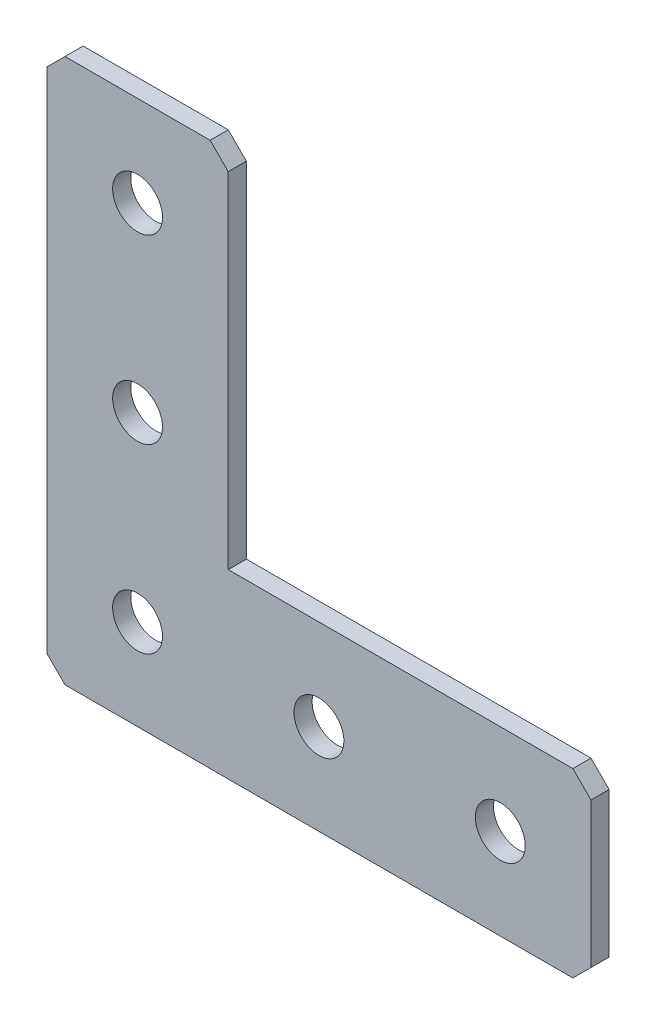
ISO-10303-21;
HEADER;
FILE_DESCRIPTION(('STEP AP214'),'2;1');
FILE_NAME('part.step','',(''),(''),'','','');
FILE_SCHEMA(('AUTOMOTIVE_DESIGN { 1 0 10303 214 1 1 1 1 }'));
ENDSEC;
DATA;
#1=APPLICATION_CONTEXT('core data for automotive mechanical design processes');
#2=APPLICATION_PROTOCOL_DEFINITION('international standard','automotive_design',2000,#1);
#3=PRODUCT_CONTEXT('',#1,'mechanical');
#4=PRODUCT('Part','Part','',(#3));
#5=PRODUCT_RELATED_PRODUCT_CATEGORY('part','',(#4));
#6=PRODUCT_DEFINITION_FORMATION('','',#4);
#7=PRODUCT_DEFINITION_CONTEXT('part definition',#1,'design');
#8=PRODUCT_DEFINITION('design','',#6,#7);
#9=PRODUCT_DEFINITION_SHAPE('','',#8);
#10=(LENGTH_UNIT() NAMED_UNIT(*) SI_UNIT(.MILLI.,.METRE.));
#11=(NAMED_UNIT(*) PLANE_ANGLE_UNIT() SI_UNIT($,.RADIAN.));
#12=(NAMED_UNIT(*) SI_UNIT($,.STERADIAN.) SOLID_ANGLE_UNIT());
#13=UNCERTAINTY_MEASURE_WITH_UNIT(LENGTH_MEASURE(1.E-05),#10,'distance_accuracy_value','');
#14=(GEOMETRIC_REPRESENTATION_CONTEXT(3) GLOBAL_UNCERTAINTY_ASSIGNED_CONTEXT((#13)) GLOBAL_UNIT_ASSIGNED_CONTEXT((#10,
#11,#12)) REPRESENTATION_CONTEXT('',''));
#15=CARTESIAN_POINT('',(0.,0.,0.));
#16=DIRECTION('',(0.,0.,1.));
#17=DIRECTION('',(1.,0.,0.));
#18=AXIS2_PLACEMENT_3D('',#15,#16,#17);
#19=CARTESIAN_POINT('',(20.,0.,-2.));
#20=DIRECTION('',(0.,-1.,0.));
#21=DIRECTION('',(1.,0.,0.));
#22=AXIS2_PLACEMENT_3D('',#19,#20,#21);
#23=PLANE('',#22);
#24=DIRECTION('',(1.,0.,0.));
#25=VECTOR('',#24,1.);
#26=CARTESIAN_POINT('',(20.,0.,-2.));
#27=LINE('',#26,#25);
#28=CARTESIAN_POINT('',(2.00000000000001,0.,-2.));
#29=VERTEX_POINT('',#28);
#30=CARTESIAN_POINT('',(18.,0.,-2.));
#31=VERTEX_POINT('',#30);
#32=EDGE_CURVE('E137',#29,#31,#27,.T.);
#33=ORIENTED_EDGE('',*,*,#32,.F.);
#34=DIRECTION('',(0.,0.,1.));
#35=VECTOR('',#34,1.);
#36=CARTESIAN_POINT('',(2.00000000000001,0.,-2.));
#37=LINE('',#36,#35);
#38=CARTESIAN_POINT('',(2.00000000000001,0.,0.));
#39=VERTEX_POINT('',#38);
#40=EDGE_CURVE('E189',#29,#39,#37,.T.);
#41=ORIENTED_EDGE('',*,*,#40,.T.);
#42=DIRECTION('',(1.,0.,0.));
#43=VECTOR('',#42,1.);
#44=CARTESIAN_POINT('',(20.,0.,0.));
#45=LINE('',#44,#43);
#46=CARTESIAN_POINT('',(18.,0.,0.));
#47=VERTEX_POINT('',#46);
#48=EDGE_CURVE('E166',#39,#47,#45,.T.);
#49=ORIENTED_EDGE('',*,*,#48,.T.);
#50=DIRECTION('',(0.,0.,-1.));
#51=VECTOR('',#50,1.);
#52=CARTESIAN_POINT('',(18.,0.,-2.));
#53=LINE('',#52,#51);
#54=EDGE_CURVE('E148',#47,#31,#53,.T.);
#55=ORIENTED_EDGE('',*,*,#54,.T.);
#56=EDGE_LOOP('',(#33,#41,#49,#55));
#57=FACE_BOUND('',#56,.T.);
#58=ADVANCED_FACE('F39',(#57),#23,.F.);
#59=CARTESIAN_POINT('',(20.,-40.,-2.));
#60=DIRECTION('',(-1.,0.,0.));
#61=DIRECTION('',(0.,-1.,0.));
#62=AXIS2_PLACEMENT_3D('',#59,#60,#61);
#63=PLANE('',#62);
#64=DIRECTION('',(0.,-1.,0.));
#65=VECTOR('',#64,1.);
#66=CARTESIAN_POINT('',(20.,-40.,-2.));
#67=LINE('',#66,#65);
#68=CARTESIAN_POINT('',(20.,-2.00000000000001,-2.));
#69=VERTEX_POINT('',#68);
#70=CARTESIAN_POINT('',(20.,-40.,-2.));
#71=VERTEX_POINT('',#70);
#72=EDGE_CURVE('E123',#69,#71,#67,.T.);
#73=ORIENTED_EDGE('',*,*,#72,.F.);
#74=DIRECTION('',(0.,0.,1.));
#75=VECTOR('',#74,1.);
#76=CARTESIAN_POINT('',(20.,-2.00000000000001,-2.));
#77=LINE('',#76,#75);
#78=CARTESIAN_POINT('',(20.,-2.00000000000001,0.));
#79=VERTEX_POINT('',#78);
#80=EDGE_CURVE('E228',#69,#79,#77,.T.);
#81=ORIENTED_EDGE('',*,*,#80,.T.);
#82=DIRECTION('',(0.,-1.,0.));
#83=VECTOR('',#82,1.);
#84=CARTESIAN_POINT('',(20.,-40.,0.));
#85=LINE('',#84,#83);
#86=CARTESIAN_POINT('',(20.,-40.,0.));
#87=VERTEX_POINT('',#86);
#88=EDGE_CURVE('E143',#79,#87,#85,.T.);
#89=ORIENTED_EDGE('',*,*,#88,.T.);
#90=DIRECTION('',(0.,0.,1.));
#91=VECTOR('',#90,1.);
#92=CARTESIAN_POINT('',(20.,-40.,-2.));
#93=LINE('',#92,#91);
#94=EDGE_CURVE('E140',#71,#87,#93,.T.);
#95=ORIENTED_EDGE('',*,*,#94,.F.);
#96=EDGE_LOOP('',(#73,#81,#89,#95));
#97=FACE_BOUND('',#96,.T.);
#98=ADVANCED_FACE('F141',(#97),#63,.F.);
#99=CARTESIAN_POINT('',(60.,-40.,-2.));
#100=DIRECTION('',(0.,-1.,0.));
#101=DIRECTION('',(1.,0.,0.));
#102=AXIS2_PLACEMENT_3D('',#99,#100,#101);
#103=PLANE('',#102);
#104=DIRECTION('',(1.,0.,0.));
#105=VECTOR('',#104,1.);
#106=CARTESIAN_POINT('',(60.,-40.,0.));
#107=LINE('',#106,#105);
#108=CARTESIAN_POINT('',(58.,-40.,0.));
#109=VERTEX_POINT('',#108);
#110=EDGE_CURVE('E173',#87,#109,#107,.T.);
#111=ORIENTED_EDGE('',*,*,#110,.T.);
#112=DIRECTION('',(0.,0.,-1.));
#113=VECTOR('',#112,1.);
#114=CARTESIAN_POINT('',(58.,-40.,-2.));
#115=LINE('',#114,#113);
#116=CARTESIAN_POINT('',(58.,-40.,-2.));
#117=VERTEX_POINT('',#116);
#118=EDGE_CURVE('E153',#109,#117,#115,.T.);
#119=ORIENTED_EDGE('',*,*,#118,.T.);
#120=DIRECTION('',(1.,0.,0.));
#121=VECTOR('',#120,1.);
#122=CARTESIAN_POINT('',(60.,-40.,-2.));
#123=LINE('',#122,#121);
#124=EDGE_CURVE('E128',#71,#117,#123,.T.);
#125=ORIENTED_EDGE('',*,*,#124,.F.);
#126=ORIENTED_EDGE('',*,*,#94,.T.);
#127=EDGE_LOOP('',(#111,#119,#125,#126));
#128=FACE_BOUND('',#127,.T.);
#129=ADVANCED_FACE('F151',(#128),#103,.F.);
#130=CARTESIAN_POINT('',(60.,-60.,-2.));
#131=DIRECTION('',(-1.,0.,0.));
#132=DIRECTION('',(0.,-1.,0.));
#133=AXIS2_PLACEMENT_3D('',#130,#131,#132);
#134=PLANE('',#133);
#135=DIRECTION('',(0.,-1.,0.));
#136=VECTOR('',#135,1.);
#137=CARTESIAN_POINT('',(60.,-60.,-2.));
#138=LINE('',#137,#136);
#139=CARTESIAN_POINT('',(60.,-42.,-2.));
#140=VERTEX_POINT('',#139);
#141=CARTESIAN_POINT('',(60.,-58.,-2.));
#142=VERTEX_POINT('',#141);
#143=EDGE_CURVE('E155',#140,#142,#138,.T.);
#144=ORIENTED_EDGE('',*,*,#143,.F.);
#145=DIRECTION('',(0.,0.,1.));
#146=VECTOR('',#145,1.);
#147=CARTESIAN_POINT('',(60.,-42.,-2.));
#148=LINE('',#147,#146);
#149=CARTESIAN_POINT('',(60.,-42.,0.));
#150=VERTEX_POINT('',#149);
#151=EDGE_CURVE('E234',#140,#150,#148,.T.);
#152=ORIENTED_EDGE('',*,*,#151,.T.);
#153=DIRECTION('',(0.,-1.,0.));
#154=VECTOR('',#153,1.);
#155=CARTESIAN_POINT('',(60.,-60.,0.));
#156=LINE('',#155,#154);
#157=CARTESIAN_POINT('',(60.,-58.,0.));
#158=VERTEX_POINT('',#157);
#159=EDGE_CURVE('E176',#150,#158,#156,.T.);
#160=ORIENTED_EDGE('',*,*,#159,.T.);
#161=DIRECTION('',(0.,0.,-1.));
#162=VECTOR('',#161,1.);
#163=CARTESIAN_POINT('',(60.,-58.,-2.));
#164=LINE('',#163,#162);
#165=EDGE_CURVE('E231',#158,#142,#164,.T.);
#166=ORIENTED_EDGE('',*,*,#165,.T.);
#167=EDGE_LOOP('',(#144,#152,#160,#166));
#168=FACE_BOUND('',#167,.T.);
#169=ADVANCED_FACE('F244',(#168),#134,.F.);
#170=CARTESIAN_POINT('',(0.,-60.,-2.));
#171=DIRECTION('',(0.,1.,0.));
#172=DIRECTION('',(0.,0.,1.));
#173=AXIS2_PLACEMENT_3D('',#170,#171,#172);
#174=PLANE('',#173);
#175=DIRECTION('',(-1.,0.,0.));
#176=VECTOR('',#175,1.);
#177=CARTESIAN_POINT('',(0.,-60.,-2.));
#178=LINE('',#177,#176);
#179=CARTESIAN_POINT('',(58.,-60.,-2.));
#180=VERTEX_POINT('',#179);
#181=CARTESIAN_POINT('',(2.00000000000001,-60.,-2.));
#182=VERTEX_POINT('',#181);
#183=EDGE_CURVE('E158',#180,#182,#178,.T.);
#184=ORIENTED_EDGE('',*,*,#183,.F.);
#185=DIRECTION('',(0.,0.,1.));
#186=VECTOR('',#185,1.);
#187=CARTESIAN_POINT('',(58.,-60.,-2.));
#188=LINE('',#187,#186);
#189=CARTESIAN_POINT('',(58.,-60.,0.));
#190=VERTEX_POINT('',#189);
#191=EDGE_CURVE('E11',#180,#190,#188,.T.);
#192=ORIENTED_EDGE('',*,*,#191,.T.);
#193=DIRECTION('',(-1.,0.,0.));
#194=VECTOR('',#193,1.);
#195=CARTESIAN_POINT('',(0.,-60.,0.));
#196=LINE('',#195,#194);
#197=CARTESIAN_POINT('',(2.00000000000001,-60.,0.));
#198=VERTEX_POINT('',#197);
#199=EDGE_CURVE('E180',#190,#198,#196,.T.);
#200=ORIENTED_EDGE('',*,*,#199,.T.);
#201=DIRECTION('',(0.,0.,-1.));
#202=VECTOR('',#201,1.);
#203=CARTESIAN_POINT('',(2.00000000000002,-60.,-2.));
#204=LINE('',#203,#202);
#205=EDGE_CURVE('E48',#198,#182,#204,.T.);
#206=ORIENTED_EDGE('',*,*,#205,.T.);
#207=EDGE_LOOP('',(#184,#192,#200,#206));
#208=FACE_BOUND('',#207,.T.);
#209=ADVANCED_FACE('F254',(#208),#174,.F.);
#210=CARTESIAN_POINT('',(0.,0.,-2.));
#211=DIRECTION('',(1.,0.,0.));
#212=DIRECTION('',(0.,0.,-1.));
#213=AXIS2_PLACEMENT_3D('',#210,#211,#212);
#214=PLANE('',#213);
#215=DIRECTION('',(0.,1.,0.));
#216=VECTOR('',#215,1.);
#217=CARTESIAN_POINT('',(0.,0.,0.));
#218=LINE('',#217,#216);
#219=CARTESIAN_POINT('',(0.,-58.,0.));
#220=VERTEX_POINT('',#219);
#221=CARTESIAN_POINT('',(0.,-2.00000000000002,0.));
#222=VERTEX_POINT('',#221);
#223=EDGE_CURVE('E183',#220,#222,#218,.T.);
#224=ORIENTED_EDGE('',*,*,#223,.T.);
#225=DIRECTION('',(0.,0.,-1.));
#226=VECTOR('',#225,1.);
#227=CARTESIAN_POINT('',(0.,-2.00000000000002,-2.));
#228=LINE('',#227,#226);
#229=CARTESIAN_POINT('',(0.,-2.00000000000002,-2.));
#230=VERTEX_POINT('',#229);
#231=EDGE_CURVE('E212',#222,#230,#228,.T.);
#232=ORIENTED_EDGE('',*,*,#231,.T.);
#233=DIRECTION('',(0.,1.,0.));
#234=VECTOR('',#233,1.);
#235=CARTESIAN_POINT('',(0.,0.,-2.));
#236=LINE('',#235,#234);
#237=CARTESIAN_POINT('',(0.,-58.,-2.));
#238=VERTEX_POINT('',#237);
#239=EDGE_CURVE('E149',#238,#230,#236,.T.);
#240=ORIENTED_EDGE('',*,*,#239,.F.);
#241=DIRECTION('',(0.,0.,1.));
#242=VECTOR('',#241,1.);
#243=CARTESIAN_POINT('',(0.,-58.,-2.));
#244=LINE('',#243,#242);
#245=EDGE_CURVE('E208',#238,#220,#244,.T.);
#246=ORIENTED_EDGE('',*,*,#245,.T.);
#247=EDGE_LOOP('',(#224,#232,#240,#246));
#248=FACE_BOUND('',#247,.T.);
#249=ADVANCED_FACE('F261',(#248),#214,.F.);
#250=CARTESIAN_POINT('',(0.,0.,-2.));
#251=DIRECTION('',(0.,0.,1.));
#252=DIRECTION('',(1.,0.,0.));
#253=AXIS2_PLACEMENT_3D('',#250,#251,#252);
#254=PLANE('',#253);
#255=CARTESIAN_POINT('',(30.,-50.,-2.));
#256=DIRECTION('',(0.,0.,-1.));
#257=DIRECTION('',(0.,1.,0.));
#258=AXIS2_PLACEMENT_3D('',#255,#256,#257);
#259=CIRCLE('',#258,2.75);
#260=CARTESIAN_POINT('',(30.,-47.25,-2.));
#261=VERTEX_POINT('',#260);
#262=EDGE_CURVE('E307',#261,#261,#259,.T.);
#263=ORIENTED_EDGE('',*,*,#262,.F.);
#264=EDGE_LOOP('',(#263));
#265=FACE_BOUND('',#264,.T.);
#266=CARTESIAN_POINT('',(10.,-50.,-2.));
#267=DIRECTION('',(0.,0.,-1.));
#268=DIRECTION('',(0.,1.,0.));
#269=AXIS2_PLACEMENT_3D('',#266,#267,#268);
#270=CIRCLE('',#269,2.75);
#271=CARTESIAN_POINT('',(10.,-47.25,-2.));
#272=VERTEX_POINT('',#271);
#273=EDGE_CURVE('E299',#272,#272,#270,.T.);
#274=ORIENTED_EDGE('',*,*,#273,.F.);
#275=EDGE_LOOP('',(#274));
#276=FACE_BOUND('',#275,.T.);
#277=CARTESIAN_POINT('',(10.,-30.,-2.));
#278=DIRECTION('',(0.,0.,-1.));
#279=DIRECTION('',(0.,1.,0.));
#280=AXIS2_PLACEMENT_3D('',#277,#278,#279);
#281=CIRCLE('',#280,2.75);
#282=CARTESIAN_POINT('',(10.,-27.25,-2.));
#283=VERTEX_POINT('',#282);
#284=EDGE_CURVE('E291',#283,#283,#281,.T.);
#285=ORIENTED_EDGE('',*,*,#284,.F.);
#286=EDGE_LOOP('',(#285));
#287=FACE_BOUND('',#286,.T.);
#288=CARTESIAN_POINT('',(10.,-9.99999999999999,-2.));
#289=DIRECTION('',(0.,0.,-1.));
#290=DIRECTION('',(0.,1.,0.));
#291=AXIS2_PLACEMENT_3D('',#288,#289,#290);
#292=CIRCLE('',#291,2.75);
#293=CARTESIAN_POINT('',(10.,-7.24999999999999,-2.));
#294=VERTEX_POINT('',#293);
#295=EDGE_CURVE('E283',#294,#294,#292,.T.);
#296=ORIENTED_EDGE('',*,*,#295,.F.);
#297=EDGE_LOOP('',(#296));
#298=FACE_BOUND('',#297,.T.);
#299=CARTESIAN_POINT('',(50.,-50.,-2.));
#300=DIRECTION('',(0.,0.,-1.));
#301=DIRECTION('',(0.,1.,0.));
#302=AXIS2_PLACEMENT_3D('',#299,#300,#301);
#303=CIRCLE('',#302,2.75);
#304=CARTESIAN_POINT('',(50.,-47.25,-2.));
#305=VERTEX_POINT('',#304);
#306=EDGE_CURVE('E275',#305,#305,#303,.T.);
#307=ORIENTED_EDGE('',*,*,#306,.F.);
#308=EDGE_LOOP('',(#307));
#309=FACE_BOUND('',#308,.T.);
#310=ORIENTED_EDGE('',*,*,#239,.T.);
#311=DIRECTION('',(-0.707106781186546,-0.707106781186549,0.));
#312=VECTOR('',#311,1.);
#313=CARTESIAN_POINT('',(2.00000000000001,0.,-2.));
#314=LINE('',#313,#312);
#315=EDGE_CURVE('E225',#230,#29,#314,.F.);
#316=ORIENTED_EDGE('',*,*,#315,.T.);
#317=ORIENTED_EDGE('',*,*,#32,.T.);
#318=DIRECTION('',(-0.707106781186549,0.707106781186546,0.));
#319=VECTOR('',#318,1.);
#320=CARTESIAN_POINT('',(20.,-2.00000000000001,-2.));
#321=LINE('',#320,#319);
#322=EDGE_CURVE('E132',#31,#69,#321,.F.);
#323=ORIENTED_EDGE('',*,*,#322,.T.);
#324=ORIENTED_EDGE('',*,*,#72,.T.);
#325=ORIENTED_EDGE('',*,*,#124,.T.);
#326=DIRECTION('',(-0.707106781186549,0.707106781186546,0.));
#327=VECTOR('',#326,1.);
#328=CARTESIAN_POINT('',(60.,-42.,-2.));
#329=LINE('',#328,#327);
#330=EDGE_CURVE('E220',#117,#140,#329,.F.);
#331=ORIENTED_EDGE('',*,*,#330,.T.);
#332=ORIENTED_EDGE('',*,*,#143,.T.);
#333=DIRECTION('',(0.707106781186546,0.707106781186549,0.));
#334=VECTOR('',#333,1.);
#335=CARTESIAN_POINT('',(58.,-60.,-2.));
#336=LINE('',#335,#334);
#337=EDGE_CURVE('E61',#142,#180,#336,.F.);
#338=ORIENTED_EDGE('',*,*,#337,.T.);
#339=ORIENTED_EDGE('',*,*,#183,.T.);
#340=DIRECTION('',(0.707106781186549,-0.707106781186546,0.));
#341=VECTOR('',#340,1.);
#342=CARTESIAN_POINT('',(0.,-58.,-2.));
#343=LINE('',#342,#341);
#344=EDGE_CURVE('E215',#182,#238,#343,.F.);
#345=ORIENTED_EDGE('',*,*,#344,.T.);
#346=EDGE_LOOP('',(#310,#316,#317,#323,#324,#325,#331,#332,#338,#339,#345));
#347=FACE_BOUND('',#346,.T.);
#348=ADVANCED_FACE('F126',(#265,#276,#287,#298,#309,#347),#254,.F.);
#349=CARTESIAN_POINT('',(0.,0.,0.));
#350=DIRECTION('',(0.,0.,1.));
#351=DIRECTION('',(1.,0.,0.));
#352=AXIS2_PLACEMENT_3D('',#349,#350,#351);
#353=PLANE('',#352);
#354=CARTESIAN_POINT('',(30.,-50.,0.));
#355=DIRECTION('',(0.,0.,-1.));
#356=DIRECTION('',(0.,1.,0.));
#357=AXIS2_PLACEMENT_3D('',#354,#355,#356);
#358=CIRCLE('',#357,2.75);
#359=CARTESIAN_POINT('',(30.,-47.25,0.));
#360=VERTEX_POINT('',#359);
#361=EDGE_CURVE('E303',#360,#360,#358,.T.);
#362=ORIENTED_EDGE('',*,*,#361,.T.);
#363=EDGE_LOOP('',(#362));
#364=FACE_BOUND('',#363,.T.);
#365=CARTESIAN_POINT('',(10.,-50.,0.));
#366=DIRECTION('',(0.,0.,-1.));
#367=DIRECTION('',(0.,1.,0.));
#368=AXIS2_PLACEMENT_3D('',#365,#366,#367);
#369=CIRCLE('',#368,2.75);
#370=CARTESIAN_POINT('',(10.,-47.25,0.));
#371=VERTEX_POINT('',#370);
#372=EDGE_CURVE('E295',#371,#371,#369,.T.);
#373=ORIENTED_EDGE('',*,*,#372,.T.);
#374=EDGE_LOOP('',(#373));
#375=FACE_BOUND('',#374,.T.);
#376=CARTESIAN_POINT('',(10.,-30.,0.));
#377=DIRECTION('',(0.,0.,-1.));
#378=DIRECTION('',(0.,1.,0.));
#379=AXIS2_PLACEMENT_3D('',#376,#377,#378);
#380=CIRCLE('',#379,2.75);
#381=CARTESIAN_POINT('',(10.,-27.25,0.));
#382=VERTEX_POINT('',#381);
#383=EDGE_CURVE('E287',#382,#382,#380,.T.);
#384=ORIENTED_EDGE('',*,*,#383,.T.);
#385=EDGE_LOOP('',(#384));
#386=FACE_BOUND('',#385,.T.);
#387=CARTESIAN_POINT('',(10.,-9.99999999999999,0.));
#388=DIRECTION('',(0.,0.,-1.));
#389=DIRECTION('',(0.,1.,0.));
#390=AXIS2_PLACEMENT_3D('',#387,#388,#389);
#391=CIRCLE('',#390,2.75);
#392=CARTESIAN_POINT('',(10.,-7.25,0.));
#393=VERTEX_POINT('',#392);
#394=EDGE_CURVE('E279',#393,#393,#391,.T.);
#395=ORIENTED_EDGE('',*,*,#394,.T.);
#396=EDGE_LOOP('',(#395));
#397=FACE_BOUND('',#396,.T.);
#398=CARTESIAN_POINT('',(50.,-50.,0.));
#399=DIRECTION('',(0.,0.,-1.));
#400=DIRECTION('',(0.,1.,0.));
#401=AXIS2_PLACEMENT_3D('',#398,#399,#400);
#402=CIRCLE('',#401,2.75);
#403=CARTESIAN_POINT('',(50.,-47.25,0.));
#404=VERTEX_POINT('',#403);
#405=EDGE_CURVE('E170',#404,#404,#402,.T.);
#406=ORIENTED_EDGE('',*,*,#405,.T.);
#407=EDGE_LOOP('',(#406));
#408=FACE_BOUND('',#407,.T.);
#409=ORIENTED_EDGE('',*,*,#48,.F.);
#410=DIRECTION('',(0.707106781186546,0.707106781186549,0.));
#411=VECTOR('',#410,1.);
#412=CARTESIAN_POINT('',(1.00000000000001,-1.,0.));
#413=LINE('',#412,#411);
#414=EDGE_CURVE('E205',#39,#222,#413,.F.);
#415=ORIENTED_EDGE('',*,*,#414,.T.);
#416=ORIENTED_EDGE('',*,*,#223,.F.);
#417=DIRECTION('',(-0.707106781186549,0.707106781186546,0.));
#418=VECTOR('',#417,1.);
#419=CARTESIAN_POINT('',(-29.,-29.0000000000001,0.));
#420=LINE('',#419,#418);
#421=EDGE_CURVE('E193',#220,#198,#420,.F.);
#422=ORIENTED_EDGE('',*,*,#421,.T.);
#423=ORIENTED_EDGE('',*,*,#199,.F.);
#424=DIRECTION('',(-0.707106781186546,-0.707106781186549,0.));
#425=VECTOR('',#424,1.);
#426=CARTESIAN_POINT('',(59.0000000000001,-58.9999999999999,0.));
#427=LINE('',#426,#425);
#428=EDGE_CURVE('E196',#190,#158,#427,.F.);
#429=ORIENTED_EDGE('',*,*,#428,.T.);
#430=ORIENTED_EDGE('',*,*,#159,.F.);
#431=DIRECTION('',(0.707106781186549,-0.707106781186546,0.));
#432=VECTOR('',#431,1.);
#433=CARTESIAN_POINT('',(8.9999999999999,8.99999999999993,0.));
#434=LINE('',#433,#432);
#435=EDGE_CURVE('E199',#150,#109,#434,.F.);
#436=ORIENTED_EDGE('',*,*,#435,.T.);
#437=ORIENTED_EDGE('',*,*,#110,.F.);
#438=ORIENTED_EDGE('',*,*,#88,.F.);
#439=DIRECTION('',(0.707106781186549,-0.707106781186546,0.));
#440=VECTOR('',#439,1.);
#441=CARTESIAN_POINT('',(8.99999999999996,8.99999999999999,0.));
#442=LINE('',#441,#440);
#443=EDGE_CURVE('E202',#79,#47,#442,.F.);
#444=ORIENTED_EDGE('',*,*,#443,.T.);
#445=EDGE_LOOP('',(#409,#415,#416,#422,#423,#429,#430,#436,#437,#438,#444));
#446=FACE_BOUND('',#445,.T.);
#447=ADVANCED_FACE('F249',(#364,#375,#386,#397,#408,#446),#353,.T.);
#448=CARTESIAN_POINT('',(50.,-50.,-2.));
#449=DIRECTION('',(0.,0.,-1.));
#450=DIRECTION('',(0.,1.,0.));
#451=AXIS2_PLACEMENT_3D('',#448,#449,#450);
#452=CYLINDRICAL_SURFACE('',#451,2.75);
#453=ORIENTED_EDGE('',*,*,#405,.F.);
#454=EDGE_LOOP('',(#453));
#455=FACE_BOUND('',#454,.T.);
#456=ORIENTED_EDGE('',*,*,#306,.T.);
#457=EDGE_LOOP('',(#456));
#458=FACE_BOUND('',#457,.T.);
#459=ADVANCED_FACE('F325',(#455,#458),#452,.F.);
#460=CARTESIAN_POINT('',(10.,-9.99999999999999,-2.));
#461=DIRECTION('',(0.,0.,-1.));
#462=DIRECTION('',(0.,1.,0.));
#463=AXIS2_PLACEMENT_3D('',#460,#461,#462);
#464=CYLINDRICAL_SURFACE('',#463,2.75);
#465=ORIENTED_EDGE('',*,*,#394,.F.);
#466=EDGE_LOOP('',(#465));
#467=FACE_BOUND('',#466,.T.);
#468=ORIENTED_EDGE('',*,*,#295,.T.);
#469=EDGE_LOOP('',(#468));
#470=FACE_BOUND('',#469,.T.);
#471=ADVANCED_FACE('F327',(#467,#470),#464,.F.);
#472=CARTESIAN_POINT('',(10.,-30.,-2.));
#473=DIRECTION('',(0.,0.,-1.));
#474=DIRECTION('',(0.,1.,0.));
#475=AXIS2_PLACEMENT_3D('',#472,#473,#474);
#476=CYLINDRICAL_SURFACE('',#475,2.75);
#477=ORIENTED_EDGE('',*,*,#383,.F.);
#478=EDGE_LOOP('',(#477));
#479=FACE_BOUND('',#478,.T.);
#480=ORIENTED_EDGE('',*,*,#284,.T.);
#481=EDGE_LOOP('',(#480));
#482=FACE_BOUND('',#481,.T.);
#483=ADVANCED_FACE('F334',(#479,#482),#476,.F.);
#484=CARTESIAN_POINT('',(10.,-50.,-2.));
#485=DIRECTION('',(0.,0.,-1.));
#486=DIRECTION('',(0.,1.,0.));
#487=AXIS2_PLACEMENT_3D('',#484,#485,#486);
#488=CYLINDRICAL_SURFACE('',#487,2.75);
#489=ORIENTED_EDGE('',*,*,#372,.F.);
#490=EDGE_LOOP('',(#489));
#491=FACE_BOUND('',#490,.T.);
#492=ORIENTED_EDGE('',*,*,#273,.T.);
#493=EDGE_LOOP('',(#492));
#494=FACE_BOUND('',#493,.T.);
#495=ADVANCED_FACE('F447',(#491,#494),#488,.F.);
#496=CARTESIAN_POINT('',(30.,-50.,-2.));
#497=DIRECTION('',(0.,0.,-1.));
#498=DIRECTION('',(0.,1.,0.));
#499=AXIS2_PLACEMENT_3D('',#496,#497,#498);
#500=CYLINDRICAL_SURFACE('',#499,2.75);
#501=ORIENTED_EDGE('',*,*,#361,.F.);
#502=EDGE_LOOP('',(#501));
#503=FACE_BOUND('',#502,.T.);
#504=ORIENTED_EDGE('',*,*,#262,.T.);
#505=EDGE_LOOP('',(#504));
#506=FACE_BOUND('',#505,.T.);
#507=ADVANCED_FACE('F312',(#503,#506),#500,.F.);
#508=CARTESIAN_POINT('',(2.00000000000001,0.,-2.));
#509=DIRECTION('',(0.707106781186549,-0.707106781186546,0.));
#510=DIRECTION('',(0.,0.,1.));
#511=AXIS2_PLACEMENT_3D('',#508,#509,#510);
#512=PLANE('',#511);
#513=ORIENTED_EDGE('',*,*,#315,.F.);
#514=ORIENTED_EDGE('',*,*,#231,.F.);
#515=ORIENTED_EDGE('',*,*,#414,.F.);
#516=ORIENTED_EDGE('',*,*,#40,.F.);
#517=EDGE_LOOP('',(#513,#514,#515,#516));
#518=FACE_BOUND('',#517,.T.);
#519=ADVANCED_FACE('F266',(#518),#512,.F.);
#520=CARTESIAN_POINT('',(20.,-2.00000000000001,-2.));
#521=DIRECTION('',(-0.707106781186546,-0.707106781186549,0.));
#522=DIRECTION('',(0.,0.,1.));
#523=AXIS2_PLACEMENT_3D('',#520,#521,#522);
#524=PLANE('',#523);
#525=ORIENTED_EDGE('',*,*,#322,.F.);
#526=ORIENTED_EDGE('',*,*,#54,.F.);
#527=ORIENTED_EDGE('',*,*,#443,.F.);
#528=ORIENTED_EDGE('',*,*,#80,.F.);
#529=EDGE_LOOP('',(#525,#526,#527,#528));
#530=FACE_BOUND('',#529,.T.);
#531=ADVANCED_FACE('F350',(#530),#524,.F.);
#532=CARTESIAN_POINT('',(60.,-42.,-2.));
#533=DIRECTION('',(-0.707106781186546,-0.707106781186549,0.));
#534=DIRECTION('',(0.,0.,1.));
#535=AXIS2_PLACEMENT_3D('',#532,#533,#534);
#536=PLANE('',#535);
#537=ORIENTED_EDGE('',*,*,#330,.F.);
#538=ORIENTED_EDGE('',*,*,#118,.F.);
#539=ORIENTED_EDGE('',*,*,#435,.F.);
#540=ORIENTED_EDGE('',*,*,#151,.F.);
#541=EDGE_LOOP('',(#537,#538,#539,#540));
#542=FACE_BOUND('',#541,.T.);
#543=ADVANCED_FACE('F353',(#542),#536,.F.);
#544=CARTESIAN_POINT('',(58.,-60.,-2.));
#545=DIRECTION('',(-0.707106781186549,0.707106781186546,0.));
#546=DIRECTION('',(0.,0.,1.));
#547=AXIS2_PLACEMENT_3D('',#544,#545,#546);
#548=PLANE('',#547);
#549=ORIENTED_EDGE('',*,*,#337,.F.);
#550=ORIENTED_EDGE('',*,*,#165,.F.);
#551=ORIENTED_EDGE('',*,*,#428,.F.);
#552=ORIENTED_EDGE('',*,*,#191,.F.);
#553=EDGE_LOOP('',(#549,#550,#551,#552));
#554=FACE_BOUND('',#553,.T.);
#555=ADVANCED_FACE('F253',(#554),#548,.F.);
#556=CARTESIAN_POINT('',(0.,-58.,-2.));
#557=DIRECTION('',(0.707106781186546,0.707106781186549,0.));
#558=DIRECTION('',(0.,0.,1.));
#559=AXIS2_PLACEMENT_3D('',#556,#557,#558);
#560=PLANE('',#559);
#561=ORIENTED_EDGE('',*,*,#344,.F.);
#562=ORIENTED_EDGE('',*,*,#205,.F.);
#563=ORIENTED_EDGE('',*,*,#421,.F.);
#564=ORIENTED_EDGE('',*,*,#245,.F.);
#565=EDGE_LOOP('',(#561,#562,#563,#564));
#566=FACE_BOUND('',#565,.T.);
#567=ADVANCED_FACE('F41',(#566),#560,.F.);
#568=CLOSED_SHELL('',(#58,#98,#129,#169,#209,#249,#348,#447,#459,#471,#483,#495,#507,#519,#531,
#543,#555,#567));
#569=MANIFOLD_SOLID_BREP('B2',#568);
#570=ADVANCED_BREP_SHAPE_REPRESENTATION('',(#18,#569),#14);
#571=SHAPE_DEFINITION_REPRESENTATION(#9,#570);
ENDSEC;
END-ISO-10303-21;
